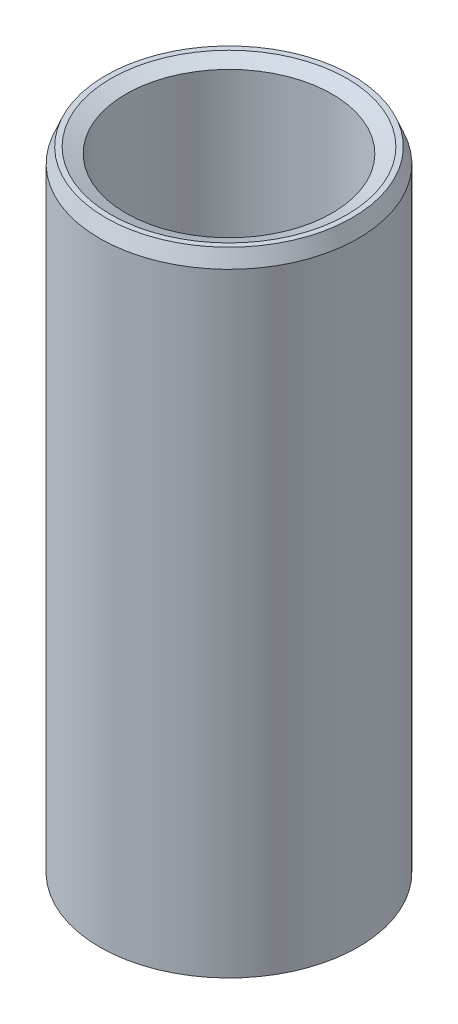
ISO-10303-21;
HEADER;
FILE_DESCRIPTION(('STEP AP214'),'2;1');
FILE_NAME('part.step','',(''),(''),'','','');
FILE_SCHEMA(('AUTOMOTIVE_DESIGN { 1 0 10303 214 1 1 1 1 }'));
ENDSEC;
DATA;
#1=APPLICATION_CONTEXT('core data for automotive mechanical design processes');
#2=APPLICATION_PROTOCOL_DEFINITION('international standard','automotive_design',2000,#1);
#3=PRODUCT_CONTEXT('',#1,'mechanical');
#4=PRODUCT('Part','Part','',(#3));
#5=PRODUCT_RELATED_PRODUCT_CATEGORY('part','',(#4));
#6=PRODUCT_DEFINITION_FORMATION('','',#4);
#7=PRODUCT_DEFINITION_CONTEXT('part definition',#1,'design');
#8=PRODUCT_DEFINITION('design','',#6,#7);
#9=PRODUCT_DEFINITION_SHAPE('','',#8);
#10=(LENGTH_UNIT() NAMED_UNIT(*) SI_UNIT(.MILLI.,.METRE.));
#11=(NAMED_UNIT(*) PLANE_ANGLE_UNIT() SI_UNIT($,.RADIAN.));
#12=(NAMED_UNIT(*) SI_UNIT($,.STERADIAN.) SOLID_ANGLE_UNIT());
#13=UNCERTAINTY_MEASURE_WITH_UNIT(LENGTH_MEASURE(1.E-05),#10,'distance_accuracy_value','');
#14=(GEOMETRIC_REPRESENTATION_CONTEXT(3) GLOBAL_UNCERTAINTY_ASSIGNED_CONTEXT((#13)) GLOBAL_UNIT_ASSIGNED_CONTEXT((#10,
#11,#12)) REPRESENTATION_CONTEXT('',''));
#15=CARTESIAN_POINT('',(0.,0.,0.));
#16=DIRECTION('',(0.,0.,1.));
#17=DIRECTION('',(1.,0.,0.));
#18=AXIS2_PLACEMENT_3D('',#15,#16,#17);
#19=CARTESIAN_POINT('',(0.,147.21137772778,0.));
#20=DIRECTION('',(0.,-1.,0.));
#21=DIRECTION('',(0.,0.,-1.));
#22=AXIS2_PLACEMENT_3D('',#19,#20,#21);
#23=CYLINDRICAL_SURFACE('',#22,30.);
#24=CARTESIAN_POINT('',(0.,1.40391109984891,0.));
#25=DIRECTION('',(0.,1.,0.));
#26=DIRECTION('',(0.,0.,1.));
#27=AXIS2_PLACEMENT_3D('',#24,#25,#26);
#28=CIRCLE('',#27,30.);
#29=CARTESIAN_POINT('',(0.,1.40391109984891,30.));
#30=VERTEX_POINT('',#29);
#31=EDGE_CURVE('E10',#30,#30,#28,.T.);
#32=ORIENTED_EDGE('',*,*,#31,.T.);
#33=EDGE_LOOP('',(#32));
#34=FACE_BOUND('',#33,.T.);
#35=CARTESIAN_POINT('',(0.,143.76015374559,0.));
#36=DIRECTION('',(0.,1.,0.));
#37=DIRECTION('',(0.,0.,1.));
#38=AXIS2_PLACEMENT_3D('',#35,#36,#37);
#39=CIRCLE('',#38,30.);
#40=CARTESIAN_POINT('',(0.,143.76015374559,30.));
#41=VERTEX_POINT('',#40);
#42=EDGE_CURVE('E50',#41,#41,#39,.F.);
#43=ORIENTED_EDGE('',*,*,#42,.T.);
#44=EDGE_LOOP('',(#43));
#45=FACE_BOUND('',#44,.T.);
#46=ADVANCED_FACE('F39',(#34,#45),#23,.T.);
#47=CARTESIAN_POINT('',(0.,147.21137772778,0.));
#48=DIRECTION('',(0.,1.,0.));
#49=DIRECTION('',(0.,0.,1.));
#50=AXIS2_PLACEMENT_3D('',#47,#48,#49);
#51=PLANE('',#50);
#52=CARTESIAN_POINT('',(0.,147.21137772778,0.));
#53=DIRECTION('',(0.,1.,0.));
#54=DIRECTION('',(0.,0.,1.));
#55=AXIS2_PLACEMENT_3D('',#52,#53,#54);
#56=CIRCLE('',#55,27.377041405051);
#57=CARTESIAN_POINT('',(0.,147.21137772778,27.377041405051));
#58=VERTEX_POINT('',#57);
#59=EDGE_CURVE('E58',#58,#58,#56,.F.);
#60=ORIENTED_EDGE('',*,*,#59,.T.);
#61=EDGE_LOOP('',(#60));
#62=FACE_BOUND('',#61,.T.);
#63=CARTESIAN_POINT('',(0.,147.21137772778,0.));
#64=DIRECTION('',(0.,1.,0.));
#65=DIRECTION('',(0.,0.,1.));
#66=AXIS2_PLACEMENT_3D('',#63,#64,#65);
#67=CIRCLE('',#66,28.5960889001511);
#68=CARTESIAN_POINT('',(0.,147.21137772778,28.5960889001511));
#69=VERTEX_POINT('',#68);
#70=EDGE_CURVE('E61',#69,#69,#67,.T.);
#71=ORIENTED_EDGE('',*,*,#70,.T.);
#72=EDGE_LOOP('',(#71));
#73=FACE_BOUND('',#72,.T.);
#74=ADVANCED_FACE('F88',(#62,#73),#51,.T.);
#75=CARTESIAN_POINT('',(0.,0.,0.));
#76=DIRECTION('',(0.,1.,0.));
#77=DIRECTION('',(0.,0.,1.));
#78=AXIS2_PLACEMENT_3D('',#75,#76,#77);
#79=PLANE('',#78);
#80=CARTESIAN_POINT('',(0.,0.,0.));
#81=DIRECTION('',(0.,1.,0.));
#82=DIRECTION('',(0.,0.,1.));
#83=AXIS2_PLACEMENT_3D('',#80,#81,#82);
#84=CIRCLE('',#83,25.3297285227096);
#85=CARTESIAN_POINT('',(0.,0.,25.3297285227096));
#86=VERTEX_POINT('',#85);
#87=EDGE_CURVE('E51',#86,#86,#84,.T.);
#88=ORIENTED_EDGE('',*,*,#87,.T.);
#89=EDGE_LOOP('',(#88));
#90=FACE_BOUND('',#89,.T.);
#91=CARTESIAN_POINT('',(0.,0.,0.));
#92=DIRECTION('',(0.,1.,0.));
#93=DIRECTION('',(0.,0.,1.));
#94=AXIS2_PLACEMENT_3D('',#91,#92,#93);
#95=CIRCLE('',#94,26.5487760178097);
#96=CARTESIAN_POINT('',(0.,0.,26.5487760178097));
#97=VERTEX_POINT('',#96);
#98=EDGE_CURVE('E54',#97,#97,#95,.F.);
#99=ORIENTED_EDGE('',*,*,#98,.T.);
#100=EDGE_LOOP('',(#99));
#101=FACE_BOUND('',#100,.T.);
#102=ADVANCED_FACE('F83',(#90,#101),#79,.F.);
#103=CARTESIAN_POINT('',(0.,147.21137772778,0.));
#104=DIRECTION('',(0.,-1.,0.));
#105=DIRECTION('',(0.,0.,-1.));
#106=AXIS2_PLACEMENT_3D('',#103,#104,#105);
#107=CYLINDRICAL_SURFACE('',#106,23.9258174228607);
#108=CARTESIAN_POINT('',(0.,145.807466627931,0.));
#109=DIRECTION('',(0.,1.,0.));
#110=DIRECTION('',(0.,0.,1.));
#111=AXIS2_PLACEMENT_3D('',#108,#109,#110);
#112=CIRCLE('',#111,23.9258174228607);
#113=CARTESIAN_POINT('',(0.,145.807466627931,23.9258174228607));
#114=VERTEX_POINT('',#113);
#115=EDGE_CURVE('E67',#114,#114,#112,.T.);
#116=ORIENTED_EDGE('',*,*,#115,.T.);
#117=EDGE_LOOP('',(#116));
#118=FACE_BOUND('',#117,.T.);
#119=CARTESIAN_POINT('',(0.,3.45122398219033,0.));
#120=DIRECTION('',(0.,1.,0.));
#121=DIRECTION('',(0.,0.,1.));
#122=AXIS2_PLACEMENT_3D('',#119,#120,#121);
#123=CIRCLE('',#122,23.9258174228607);
#124=CARTESIAN_POINT('',(0.,3.45122398219033,23.9258174228607));
#125=VERTEX_POINT('',#124);
#126=EDGE_CURVE('E69',#125,#125,#123,.F.);
#127=ORIENTED_EDGE('',*,*,#126,.T.);
#128=EDGE_LOOP('',(#127));
#129=FACE_BOUND('',#128,.T.);
#130=ADVANCED_FACE('F71',(#118,#129),#107,.F.);
#131=CARTESIAN_POINT('',(0.,145.807466627931,0.));
#132=DIRECTION('',(0.,1.,0.));
#133=DIRECTION('',(0.,0.,1.));
#134=AXIS2_PLACEMENT_3D('',#131,#132,#133);
#135=CONICAL_SURFACE('',#134,23.9258174228607,1.18445329981575);
#136=ORIENTED_EDGE('',*,*,#59,.F.);
#137=EDGE_LOOP('',(#136));
#138=FACE_BOUND('',#137,.T.);
#139=ORIENTED_EDGE('',*,*,#115,.F.);
#140=EDGE_LOOP('',(#139));
#141=FACE_BOUND('',#140,.T.);
#142=ADVANCED_FACE('F77',(#138,#141),#135,.F.);
#143=CARTESIAN_POINT('',(0.,0.,0.));
#144=DIRECTION('',(0.,-1.,0.));
#145=DIRECTION('',(0.,0.,-1.));
#146=AXIS2_PLACEMENT_3D('',#143,#144,#145);
#147=CONICAL_SURFACE('',#146,25.3297285227096,0.38634302697914);
#148=ORIENTED_EDGE('',*,*,#126,.F.);
#149=EDGE_LOOP('',(#148));
#150=FACE_BOUND('',#149,.T.);
#151=ORIENTED_EDGE('',*,*,#87,.F.);
#152=EDGE_LOOP('',(#151));
#153=FACE_BOUND('',#152,.T.);
#154=ADVANCED_FACE('F73',(#150,#153),#147,.F.);
#155=CARTESIAN_POINT('',(0.,1.40391109984891,0.));
#156=DIRECTION('',(0.,1.,0.));
#157=DIRECTION('',(0.,0.,1.));
#158=AXIS2_PLACEMENT_3D('',#155,#156,#157);
#159=CONICAL_SURFACE('',#158,30.,1.18445329981576);
#160=ORIENTED_EDGE('',*,*,#98,.F.);
#161=EDGE_LOOP('',(#160));
#162=FACE_BOUND('',#161,.T.);
#163=ORIENTED_EDGE('',*,*,#31,.F.);
#164=EDGE_LOOP('',(#163));
#165=FACE_BOUND('',#164,.T.);
#166=ADVANCED_FACE('F76',(#162,#165),#159,.T.);
#167=CARTESIAN_POINT('',(0.,147.21137772778,0.));
#168=DIRECTION('',(0.,-1.,0.));
#169=DIRECTION('',(0.,0.,-1.));
#170=AXIS2_PLACEMENT_3D('',#167,#168,#169);
#171=CONICAL_SURFACE('',#170,28.5960889001511,0.386343026979138);
#172=ORIENTED_EDGE('',*,*,#42,.F.);
#173=EDGE_LOOP('',(#172));
#174=FACE_BOUND('',#173,.T.);
#175=ORIENTED_EDGE('',*,*,#70,.F.);
#176=EDGE_LOOP('',(#175));
#177=FACE_BOUND('',#176,.T.);
#178=ADVANCED_FACE('F45',(#174,#177),#171,.T.);
#179=CLOSED_SHELL('',(#46,#74,#102,#130,#142,#154,#166,#178));
#180=MANIFOLD_SOLID_BREP('B2',#179);
#181=ADVANCED_BREP_SHAPE_REPRESENTATION('',(#18,#180),#14);
#182=SHAPE_DEFINITION_REPRESENTATION(#9,#181);
ENDSEC;
END-ISO-10303-21;
